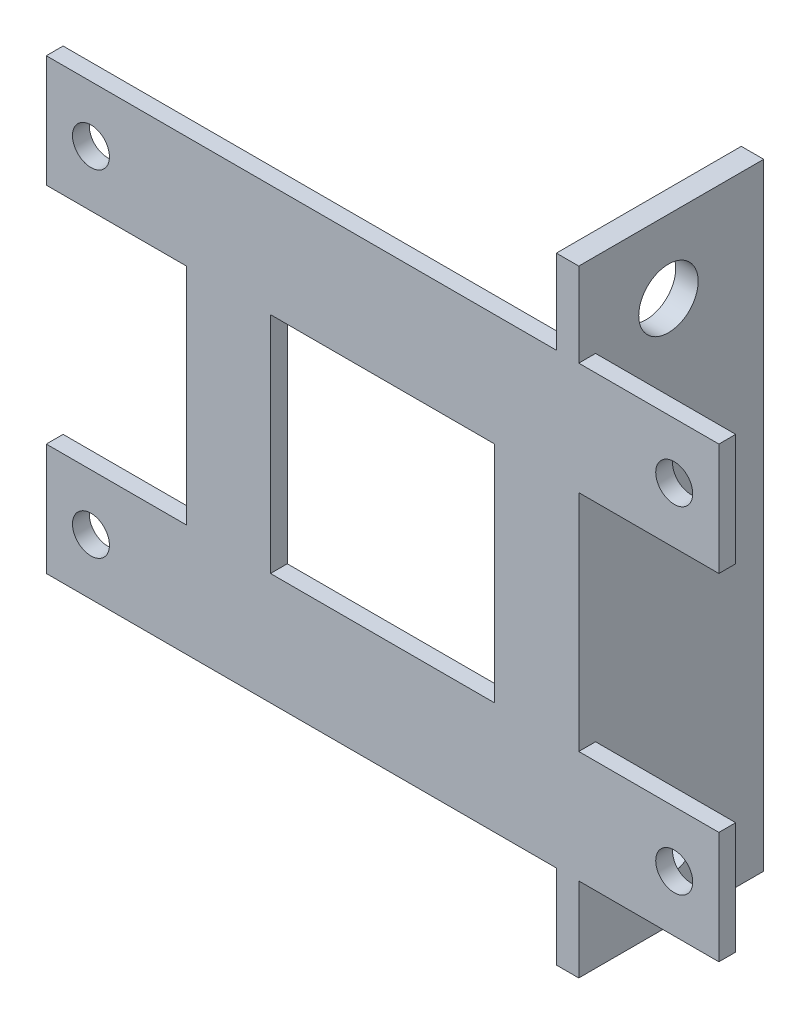
ISO-10303-21;
HEADER;
FILE_DESCRIPTION(('STEP AP214'),'2;1');
FILE_NAME('part.step','',(''),(''),'','','');
FILE_SCHEMA(('AUTOMOTIVE_DESIGN { 1 0 10303 214 1 1 1 1 }'));
ENDSEC;
DATA;
#1=APPLICATION_CONTEXT('core data for automotive mechanical design processes');
#2=APPLICATION_PROTOCOL_DEFINITION('international standard','automotive_design',2000,#1);
#3=PRODUCT_CONTEXT('',#1,'mechanical');
#4=PRODUCT('Part','Part','',(#3));
#5=PRODUCT_RELATED_PRODUCT_CATEGORY('part','',(#4));
#6=PRODUCT_DEFINITION_FORMATION('','',#4);
#7=PRODUCT_DEFINITION_CONTEXT('part definition',#1,'design');
#8=PRODUCT_DEFINITION('design','',#6,#7);
#9=PRODUCT_DEFINITION_SHAPE('','',#8);
#10=(LENGTH_UNIT() NAMED_UNIT(*) SI_UNIT(.MILLI.,.METRE.));
#11=(NAMED_UNIT(*) PLANE_ANGLE_UNIT() SI_UNIT($,.RADIAN.));
#12=(NAMED_UNIT(*) SI_UNIT($,.STERADIAN.) SOLID_ANGLE_UNIT());
#13=UNCERTAINTY_MEASURE_WITH_UNIT(LENGTH_MEASURE(1.E-05),#10,'distance_accuracy_value','');
#14=(GEOMETRIC_REPRESENTATION_CONTEXT(3) GLOBAL_UNCERTAINTY_ASSIGNED_CONTEXT((#13)) GLOBAL_UNIT_ASSIGNED_CONTEXT((#10,
#11,#12)) REPRESENTATION_CONTEXT('',''));
#15=CARTESIAN_POINT('',(0.,0.,0.));
#16=DIRECTION('',(0.,0.,1.));
#17=DIRECTION('',(1.,0.,0.));
#18=AXIS2_PLACEMENT_3D('',#15,#16,#17);
#19=CARTESIAN_POINT('',(0.,0.,-36.5));
#20=DIRECTION('',(0.,0.,-1.));
#21=DIRECTION('',(-1.,0.,0.));
#22=AXIS2_PLACEMENT_3D('',#19,#20,#21);
#23=PLANE('',#22);
#24=CARTESIAN_POINT('',(26.0145399892303,-15.,-36.5));
#25=DIRECTION('',(0.,0.,-1.));
#26=DIRECTION('',(-1.,0.,0.));
#27=AXIS2_PLACEMENT_3D('',#24,#25,#26);
#28=CIRCLE('',#27,1.65);
#29=CARTESIAN_POINT('',(24.3645399892303,-15.,-36.5));
#30=VERTEX_POINT('',#29);
#31=EDGE_CURVE('E793',#30,#30,#28,.T.);
#32=ORIENTED_EDGE('',*,*,#31,.F.);
#33=EDGE_LOOP('',(#32));
#34=FACE_BOUND('',#33,.T.);
#35=DIRECTION('',(-1.,0.,0.));
#36=VECTOR('',#35,1.);
#37=CARTESIAN_POINT('',(30.,-20.,-36.5));
#38=LINE('',#37,#36);
#39=CARTESIAN_POINT('',(30.,-20.,-36.5));
#40=VERTEX_POINT('',#39);
#41=CARTESIAN_POINT('',(17.5,-20.,-36.5));
#42=VERTEX_POINT('',#41);
#43=EDGE_CURVE('E305',#40,#42,#38,.T.);
#44=ORIENTED_EDGE('',*,*,#43,.T.);
#45=DIRECTION('',(0.,1.,0.));
#46=VECTOR('',#45,1.);
#47=CARTESIAN_POINT('',(17.5,0.,-36.5));
#48=LINE('',#47,#46);
#49=CARTESIAN_POINT('',(17.5,-10.,-36.5));
#50=VERTEX_POINT('',#49);
#51=EDGE_CURVE('E256',#42,#50,#48,.T.);
#52=ORIENTED_EDGE('',*,*,#51,.T.);
#53=DIRECTION('',(1.,0.,0.));
#54=VECTOR('',#53,1.);
#55=CARTESIAN_POINT('',(22.0290799784607,-10.,-36.5));
#56=LINE('',#55,#54);
#57=CARTESIAN_POINT('',(30.,-10.,-36.5));
#58=VERTEX_POINT('',#57);
#59=EDGE_CURVE('E300',#50,#58,#56,.T.);
#60=ORIENTED_EDGE('',*,*,#59,.T.);
#61=DIRECTION('',(0.,-1.,0.));
#62=VECTOR('',#61,1.);
#63=CARTESIAN_POINT('',(30.,-10.,-36.5));
#64=LINE('',#63,#62);
#65=EDGE_CURVE('E302',#58,#40,#64,.T.);
#66=ORIENTED_EDGE('',*,*,#65,.T.);
#67=EDGE_LOOP('',(#44,#52,#60,#66));
#68=FACE_BOUND('',#67,.T.);
#69=ADVANCED_FACE('F35',(#34,#68),#23,.T.);
#70=CARTESIAN_POINT('',(26.0145399892303,15.,-36.5));
#71=DIRECTION('',(0.,0.,-1.));
#72=DIRECTION('',(-1.,0.,0.));
#73=AXIS2_PLACEMENT_3D('',#70,#71,#72);
#74=CIRCLE('',#73,1.65);
#75=CARTESIAN_POINT('',(24.3645399892303,15.,-36.5));
#76=VERTEX_POINT('',#75);
#77=EDGE_CURVE('E389',#76,#76,#74,.T.);
#78=ORIENTED_EDGE('',*,*,#77,.F.);
#79=EDGE_LOOP('',(#78));
#80=FACE_BOUND('',#79,.T.);
#81=DIRECTION('',(-1.,0.,0.));
#82=VECTOR('',#81,1.);
#83=CARTESIAN_POINT('',(30.,10.,-36.5));
#84=LINE('',#83,#82);
#85=CARTESIAN_POINT('',(30.,10.,-36.5));
#86=VERTEX_POINT('',#85);
#87=CARTESIAN_POINT('',(17.5,10.,-36.5));
#88=VERTEX_POINT('',#87);
#89=EDGE_CURVE('E298',#86,#88,#84,.T.);
#90=ORIENTED_EDGE('',*,*,#89,.T.);
#91=CARTESIAN_POINT('',(17.5,20.,-36.5));
#92=VERTEX_POINT('',#91);
#93=EDGE_CURVE('E52',#88,#92,#48,.T.);
#94=ORIENTED_EDGE('',*,*,#93,.T.);
#95=DIRECTION('',(1.,0.,0.));
#96=VECTOR('',#95,1.);
#97=CARTESIAN_POINT('',(30.,20.,-36.5));
#98=LINE('',#97,#96);
#99=CARTESIAN_POINT('',(30.,20.,-36.5));
#100=VERTEX_POINT('',#99);
#101=EDGE_CURVE('E296',#92,#100,#98,.T.);
#102=ORIENTED_EDGE('',*,*,#101,.T.);
#103=DIRECTION('',(0.,-1.,0.));
#104=VECTOR('',#103,1.);
#105=CARTESIAN_POINT('',(30.,20.,-36.5));
#106=LINE('',#105,#104);
#107=EDGE_CURVE('E295',#100,#86,#106,.T.);
#108=ORIENTED_EDGE('',*,*,#107,.T.);
#109=EDGE_LOOP('',(#90,#94,#102,#108));
#110=FACE_BOUND('',#109,.T.);
#111=ADVANCED_FACE('F427',(#80,#110),#23,.T.);
#112=CARTESIAN_POINT('',(30.,20.,-36.5));
#113=DIRECTION('',(0.,-1.,0.));
#114=DIRECTION('',(1.,0.,0.));
#115=AXIS2_PLACEMENT_3D('',#112,#113,#114);
#116=PLANE('',#115);
#117=DIRECTION('',(0.,0.,-1.));
#118=VECTOR('',#117,1.);
#119=CARTESIAN_POINT('',(17.5,20.,-36.5));
#120=LINE('',#119,#118);
#121=CARTESIAN_POINT('',(17.5,20.,-35.));
#122=VERTEX_POINT('',#121);
#123=EDGE_CURVE('E258',#122,#92,#120,.T.);
#124=ORIENTED_EDGE('',*,*,#123,.F.);
#125=DIRECTION('',(1.,0.,0.));
#126=VECTOR('',#125,1.);
#127=CARTESIAN_POINT('',(30.,20.,-35.));
#128=LINE('',#127,#126);
#129=CARTESIAN_POINT('',(30.,20.,-35.));
#130=VERTEX_POINT('',#129);
#131=EDGE_CURVE('E292',#122,#130,#128,.T.);
#132=ORIENTED_EDGE('',*,*,#131,.T.);
#133=DIRECTION('',(0.,0.,1.));
#134=VECTOR('',#133,1.);
#135=CARTESIAN_POINT('',(30.,20.,-36.5));
#136=LINE('',#135,#134);
#137=EDGE_CURVE('E380',#100,#130,#136,.T.);
#138=ORIENTED_EDGE('',*,*,#137,.F.);
#139=ORIENTED_EDGE('',*,*,#101,.F.);
#140=EDGE_LOOP('',(#124,#132,#138,#139));
#141=FACE_BOUND('',#140,.T.);
#142=ADVANCED_FACE('F434',(#141),#116,.F.);
#143=CARTESIAN_POINT('',(30.,-20.,-36.5));
#144=DIRECTION('',(0.,1.,0.));
#145=DIRECTION('',(-1.,0.,0.));
#146=AXIS2_PLACEMENT_3D('',#143,#144,#145);
#147=PLANE('',#146);
#148=DIRECTION('',(0.,0.,1.));
#149=VECTOR('',#148,1.);
#150=CARTESIAN_POINT('',(17.5,-20.,-36.5));
#151=LINE('',#150,#149);
#152=CARTESIAN_POINT('',(17.5,-20.,-35.));
#153=VERTEX_POINT('',#152);
#154=EDGE_CURVE('E11',#42,#153,#151,.T.);
#155=ORIENTED_EDGE('',*,*,#154,.F.);
#156=ORIENTED_EDGE('',*,*,#43,.F.);
#157=DIRECTION('',(0.,0.,1.));
#158=VECTOR('',#157,1.);
#159=CARTESIAN_POINT('',(30.,-20.,-36.5));
#160=LINE('',#159,#158);
#161=CARTESIAN_POINT('',(30.,-20.,-35.));
#162=VERTEX_POINT('',#161);
#163=EDGE_CURVE('E365',#40,#162,#160,.T.);
#164=ORIENTED_EDGE('',*,*,#163,.T.);
#165=DIRECTION('',(-1.,0.,0.));
#166=VECTOR('',#165,1.);
#167=CARTESIAN_POINT('',(30.,-20.,-35.));
#168=LINE('',#167,#166);
#169=EDGE_CURVE('E334',#162,#153,#168,.T.);
#170=ORIENTED_EDGE('',*,*,#169,.T.);
#171=EDGE_LOOP('',(#155,#156,#164,#170));
#172=FACE_BOUND('',#171,.T.);
#173=ADVANCED_FACE('F442',(#172),#147,.F.);
#174=CARTESIAN_POINT('',(-26.0145399892303,-15.,-36.5));
#175=DIRECTION('',(0.,0.,-1.));
#176=DIRECTION('',(-1.,0.,0.));
#177=AXIS2_PLACEMENT_3D('',#174,#175,#176);
#178=CIRCLE('',#177,1.65);
#179=CARTESIAN_POINT('',(-27.6645399892303,-15.,-36.5));
#180=VERTEX_POINT('',#179);
#181=EDGE_CURVE('E454',#180,#180,#178,.T.);
#182=ORIENTED_EDGE('',*,*,#181,.F.);
#183=EDGE_LOOP('',(#182));
#184=FACE_BOUND('',#183,.T.);
#185=CARTESIAN_POINT('',(-26.0145399892303,15.,-36.5));
#186=DIRECTION('',(0.,0.,-1.));
#187=DIRECTION('',(-1.,0.,0.));
#188=AXIS2_PLACEMENT_3D('',#185,#186,#187);
#189=CIRCLE('',#188,1.65);
#190=CARTESIAN_POINT('',(-27.6645399892303,15.,-36.5));
#191=VERTEX_POINT('',#190);
#192=EDGE_CURVE('E458',#191,#191,#189,.T.);
#193=ORIENTED_EDGE('',*,*,#192,.F.);
#194=EDGE_LOOP('',(#193));
#195=FACE_BOUND('',#194,.T.);
#196=DIRECTION('',(0.,1.,0.));
#197=VECTOR('',#196,1.);
#198=CARTESIAN_POINT('',(15.5,0.,-36.5));
#199=LINE('',#198,#197);
#200=CARTESIAN_POINT('',(15.5,-20.,-36.5));
#201=VERTEX_POINT('',#200);
#202=CARTESIAN_POINT('',(15.5,20.,-36.5));
#203=VERTEX_POINT('',#202);
#204=EDGE_CURVE('E252',#201,#203,#199,.T.);
#205=ORIENTED_EDGE('',*,*,#204,.F.);
#206=CARTESIAN_POINT('',(-30.,-20.,-36.5));
#207=VERTEX_POINT('',#206);
#208=EDGE_CURVE('E304',#201,#207,#38,.T.);
#209=ORIENTED_EDGE('',*,*,#208,.T.);
#210=DIRECTION('',(0.,1.,0.));
#211=VECTOR('',#210,1.);
#212=CARTESIAN_POINT('',(-30.,-10.,-36.5));
#213=LINE('',#212,#211);
#214=CARTESIAN_POINT('',(-30.,-10.,-36.5));
#215=VERTEX_POINT('',#214);
#216=EDGE_CURVE('E308',#207,#215,#213,.T.);
#217=ORIENTED_EDGE('',*,*,#216,.T.);
#218=DIRECTION('',(1.,0.,0.));
#219=VECTOR('',#218,1.);
#220=CARTESIAN_POINT('',(-22.0290799784607,-10.,-36.5));
#221=LINE('',#220,#219);
#222=CARTESIAN_POINT('',(-17.5,-10.,-36.5));
#223=VERTEX_POINT('',#222);
#224=EDGE_CURVE('E310',#215,#223,#221,.T.);
#225=ORIENTED_EDGE('',*,*,#224,.T.);
#226=DIRECTION('',(0.,1.,0.));
#227=VECTOR('',#226,1.);
#228=CARTESIAN_POINT('',(-17.5,10.,-36.5));
#229=LINE('',#228,#227);
#230=CARTESIAN_POINT('',(-17.5,10.,-36.5));
#231=VERTEX_POINT('',#230);
#232=EDGE_CURVE('E312',#223,#231,#229,.T.);
#233=ORIENTED_EDGE('',*,*,#232,.T.);
#234=DIRECTION('',(-1.,0.,0.));
#235=VECTOR('',#234,1.);
#236=CARTESIAN_POINT('',(-22.0290799784607,10.,-36.5));
#237=LINE('',#236,#235);
#238=CARTESIAN_POINT('',(-30.,10.,-36.5));
#239=VERTEX_POINT('',#238);
#240=EDGE_CURVE('E314',#231,#239,#237,.T.);
#241=ORIENTED_EDGE('',*,*,#240,.T.);
#242=DIRECTION('',(0.,1.,0.));
#243=VECTOR('',#242,1.);
#244=CARTESIAN_POINT('',(-30.,10.,-36.5));
#245=LINE('',#244,#243);
#246=CARTESIAN_POINT('',(-30.,20.,-36.5));
#247=VERTEX_POINT('',#246);
#248=EDGE_CURVE('E316',#239,#247,#245,.T.);
#249=ORIENTED_EDGE('',*,*,#248,.T.);
#250=EDGE_CURVE('E293',#247,#203,#98,.T.);
#251=ORIENTED_EDGE('',*,*,#250,.T.);
#252=EDGE_LOOP('',(#205,#209,#217,#225,#233,#241,#249,#251));
#253=FACE_BOUND('',#252,.T.);
#254=DIRECTION('',(1.,0.,0.));
#255=VECTOR('',#254,1.);
#256=CARTESIAN_POINT('',(10.,10.,-36.5));
#257=LINE('',#256,#255);
#258=CARTESIAN_POINT('',(-10.,10.,-36.5));
#259=VERTEX_POINT('',#258);
#260=CARTESIAN_POINT('',(10.,10.,-36.5));
#261=VERTEX_POINT('',#260);
#262=EDGE_CURVE('E264',#259,#261,#257,.T.);
#263=ORIENTED_EDGE('',*,*,#262,.F.);
#264=DIRECTION('',(0.,1.,0.));
#265=VECTOR('',#264,1.);
#266=CARTESIAN_POINT('',(-10.,-10.,-36.5));
#267=LINE('',#266,#265);
#268=CARTESIAN_POINT('',(-10.,-10.,-36.5));
#269=VERTEX_POINT('',#268);
#270=EDGE_CURVE('E262',#269,#259,#267,.T.);
#271=ORIENTED_EDGE('',*,*,#270,.F.);
#272=DIRECTION('',(-1.,0.,0.));
#273=VECTOR('',#272,1.);
#274=CARTESIAN_POINT('',(10.,-10.,-36.5));
#275=LINE('',#274,#273);
#276=CARTESIAN_POINT('',(10.,-10.,-36.5));
#277=VERTEX_POINT('',#276);
#278=EDGE_CURVE('E270',#277,#269,#275,.T.);
#279=ORIENTED_EDGE('',*,*,#278,.F.);
#280=DIRECTION('',(0.,-1.,0.));
#281=VECTOR('',#280,1.);
#282=CARTESIAN_POINT('',(10.,-10.,-36.5));
#283=LINE('',#282,#281);
#284=EDGE_CURVE('E267',#261,#277,#283,.T.);
#285=ORIENTED_EDGE('',*,*,#284,.F.);
#286=EDGE_LOOP('',(#263,#271,#279,#285));
#287=FACE_BOUND('',#286,.T.);
#288=ADVANCED_FACE('F430',(#184,#195,#253,#287),#23,.T.);
#289=CARTESIAN_POINT('',(0.,0.,-35.));
#290=DIRECTION('',(0.,0.,-1.));
#291=DIRECTION('',(-1.,0.,0.));
#292=AXIS2_PLACEMENT_3D('',#289,#290,#291);
#293=PLANE('',#292);
#294=CARTESIAN_POINT('',(26.0145399892303,15.,-35.));
#295=DIRECTION('',(0.,0.,-1.));
#296=DIRECTION('',(-1.,0.,0.));
#297=AXIS2_PLACEMENT_3D('',#294,#295,#296);
#298=CIRCLE('',#297,1.65);
#299=CARTESIAN_POINT('',(24.3645399892303,15.,-35.));
#300=VERTEX_POINT('',#299);
#301=EDGE_CURVE('E39',#300,#300,#298,.T.);
#302=ORIENTED_EDGE('',*,*,#301,.T.);
#303=EDGE_LOOP('',(#302));
#304=FACE_BOUND('',#303,.T.);
#305=CARTESIAN_POINT('',(26.0145399892303,-15.,-35.));
#306=DIRECTION('',(0.,0.,-1.));
#307=DIRECTION('',(-1.,0.,0.));
#308=AXIS2_PLACEMENT_3D('',#305,#306,#307);
#309=CIRCLE('',#308,1.65);
#310=CARTESIAN_POINT('',(24.3645399892303,-15.,-35.));
#311=VERTEX_POINT('',#310);
#312=EDGE_CURVE('E391',#311,#311,#309,.T.);
#313=ORIENTED_EDGE('',*,*,#312,.T.);
#314=EDGE_LOOP('',(#313));
#315=FACE_BOUND('',#314,.T.);
#316=CARTESIAN_POINT('',(-26.0145399892303,-15.,-35.));
#317=DIRECTION('',(0.,0.,-1.));
#318=DIRECTION('',(-1.,0.,0.));
#319=AXIS2_PLACEMENT_3D('',#316,#317,#318);
#320=CIRCLE('',#319,1.65);
#321=CARTESIAN_POINT('',(-27.6645399892303,-15.,-35.));
#322=VERTEX_POINT('',#321);
#323=EDGE_CURVE('E388',#322,#322,#320,.T.);
#324=ORIENTED_EDGE('',*,*,#323,.T.);
#325=EDGE_LOOP('',(#324));
#326=FACE_BOUND('',#325,.T.);
#327=CARTESIAN_POINT('',(-26.0145399892303,15.,-35.));
#328=DIRECTION('',(0.,0.,-1.));
#329=DIRECTION('',(-1.,0.,0.));
#330=AXIS2_PLACEMENT_3D('',#327,#328,#329);
#331=CIRCLE('',#330,1.65);
#332=CARTESIAN_POINT('',(-27.6645399892303,15.,-35.));
#333=VERTEX_POINT('',#332);
#334=EDGE_CURVE('E385',#333,#333,#331,.T.);
#335=ORIENTED_EDGE('',*,*,#334,.T.);
#336=EDGE_LOOP('',(#335));
#337=FACE_BOUND('',#336,.T.);
#338=CARTESIAN_POINT('',(15.5,-20.,-35.));
#339=VERTEX_POINT('',#338);
#340=CARTESIAN_POINT('',(-30.,-20.,-35.));
#341=VERTEX_POINT('',#340);
#342=EDGE_CURVE('E333',#339,#341,#168,.T.);
#343=ORIENTED_EDGE('',*,*,#342,.F.);
#344=DIRECTION('',(0.,-1.,0.));
#345=VECTOR('',#344,1.);
#346=CARTESIAN_POINT('',(15.5,0.,-35.));
#347=LINE('',#346,#345);
#348=CARTESIAN_POINT('',(15.5,-27.4999999999999,-35.));
#349=VERTEX_POINT('',#348);
#350=EDGE_CURVE('E244',#339,#349,#347,.T.);
#351=ORIENTED_EDGE('',*,*,#350,.T.);
#352=DIRECTION('',(1.,0.,0.));
#353=VECTOR('',#352,1.);
#354=CARTESIAN_POINT('',(0.,-27.4999999999999,-35.));
#355=LINE('',#354,#353);
#356=CARTESIAN_POINT('',(17.5,-27.4999999999999,-35.));
#357=VERTEX_POINT('',#356);
#358=EDGE_CURVE('E208',#349,#357,#355,.T.);
#359=ORIENTED_EDGE('',*,*,#358,.T.);
#360=DIRECTION('',(0.,-1.,0.));
#361=VECTOR('',#360,1.);
#362=CARTESIAN_POINT('',(17.5,0.,-35.));
#363=LINE('',#362,#361);
#364=EDGE_CURVE('E238',#153,#357,#363,.T.);
#365=ORIENTED_EDGE('',*,*,#364,.F.);
#366=ORIENTED_EDGE('',*,*,#169,.F.);
#367=DIRECTION('',(0.,-1.,0.));
#368=VECTOR('',#367,1.);
#369=CARTESIAN_POINT('',(30.,-10.,-35.));
#370=LINE('',#369,#368);
#371=CARTESIAN_POINT('',(30.,-10.,-35.));
#372=VERTEX_POINT('',#371);
#373=EDGE_CURVE('E331',#372,#162,#370,.T.);
#374=ORIENTED_EDGE('',*,*,#373,.F.);
#375=DIRECTION('',(1.,0.,0.));
#376=VECTOR('',#375,1.);
#377=CARTESIAN_POINT('',(30.,-10.,-35.));
#378=LINE('',#377,#376);
#379=CARTESIAN_POINT('',(17.5,-10.,-35.));
#380=VERTEX_POINT('',#379);
#381=EDGE_CURVE('E329',#380,#372,#378,.T.);
#382=ORIENTED_EDGE('',*,*,#381,.F.);
#383=DIRECTION('',(0.,-1.,0.));
#384=VECTOR('',#383,1.);
#385=CARTESIAN_POINT('',(17.5,10.,-35.));
#386=LINE('',#385,#384);
#387=CARTESIAN_POINT('',(17.5,10.,-35.));
#388=VERTEX_POINT('',#387);
#389=EDGE_CURVE('E326',#388,#380,#386,.T.);
#390=ORIENTED_EDGE('',*,*,#389,.F.);
#391=DIRECTION('',(-1.,0.,0.));
#392=VECTOR('',#391,1.);
#393=CARTESIAN_POINT('',(22.0290799784607,10.,-35.));
#394=LINE('',#393,#392);
#395=CARTESIAN_POINT('',(30.,10.,-35.));
#396=VERTEX_POINT('',#395);
#397=EDGE_CURVE('E324',#396,#388,#394,.T.);
#398=ORIENTED_EDGE('',*,*,#397,.F.);
#399=DIRECTION('',(0.,-1.,0.));
#400=VECTOR('',#399,1.);
#401=CARTESIAN_POINT('',(30.,20.,-35.));
#402=LINE('',#401,#400);
#403=EDGE_CURVE('E321',#130,#396,#402,.T.);
#404=ORIENTED_EDGE('',*,*,#403,.F.);
#405=ORIENTED_EDGE('',*,*,#131,.F.);
#406=CARTESIAN_POINT('',(17.5,27.5000000000001,-35.));
#407=VERTEX_POINT('',#406);
#408=EDGE_CURVE('E240',#407,#122,#363,.T.);
#409=ORIENTED_EDGE('',*,*,#408,.F.);
#410=DIRECTION('',(1.,0.,0.));
#411=VECTOR('',#410,1.);
#412=CARTESIAN_POINT('',(0.,27.5000000000001,-35.));
#413=LINE('',#412,#411);
#414=CARTESIAN_POINT('',(15.5,27.5000000000001,-35.));
#415=VERTEX_POINT('',#414);
#416=EDGE_CURVE('E235',#415,#407,#413,.T.);
#417=ORIENTED_EDGE('',*,*,#416,.F.);
#418=CARTESIAN_POINT('',(15.5,20.,-35.));
#419=VERTEX_POINT('',#418);
#420=EDGE_CURVE('E249',#415,#419,#347,.T.);
#421=ORIENTED_EDGE('',*,*,#420,.T.);
#422=CARTESIAN_POINT('',(-30.,20.,-35.));
#423=VERTEX_POINT('',#422);
#424=EDGE_CURVE('E319',#423,#419,#128,.T.);
#425=ORIENTED_EDGE('',*,*,#424,.F.);
#426=DIRECTION('',(0.,1.,0.));
#427=VECTOR('',#426,1.);
#428=CARTESIAN_POINT('',(-30.,10.,-35.));
#429=LINE('',#428,#427);
#430=CARTESIAN_POINT('',(-30.,10.,-35.));
#431=VERTEX_POINT('',#430);
#432=EDGE_CURVE('E346',#431,#423,#429,.T.);
#433=ORIENTED_EDGE('',*,*,#432,.F.);
#434=DIRECTION('',(-1.,0.,0.));
#435=VECTOR('',#434,1.);
#436=CARTESIAN_POINT('',(-22.0290799784607,10.,-35.));
#437=LINE('',#436,#435);
#438=CARTESIAN_POINT('',(-17.5,10.,-35.));
#439=VERTEX_POINT('',#438);
#440=EDGE_CURVE('E344',#439,#431,#437,.T.);
#441=ORIENTED_EDGE('',*,*,#440,.F.);
#442=DIRECTION('',(0.,1.,0.));
#443=VECTOR('',#442,1.);
#444=CARTESIAN_POINT('',(-17.5,10.,-35.));
#445=LINE('',#444,#443);
#446=CARTESIAN_POINT('',(-17.5,-10.,-35.));
#447=VERTEX_POINT('',#446);
#448=EDGE_CURVE('E341',#447,#439,#445,.T.);
#449=ORIENTED_EDGE('',*,*,#448,.F.);
#450=DIRECTION('',(1.,0.,0.));
#451=VECTOR('',#450,1.);
#452=CARTESIAN_POINT('',(-22.0290799784607,-10.,-35.));
#453=LINE('',#452,#451);
#454=CARTESIAN_POINT('',(-30.,-10.,-35.));
#455=VERTEX_POINT('',#454);
#456=EDGE_CURVE('E339',#455,#447,#453,.T.);
#457=ORIENTED_EDGE('',*,*,#456,.F.);
#458=DIRECTION('',(0.,1.,0.));
#459=VECTOR('',#458,1.);
#460=CARTESIAN_POINT('',(-30.,-10.,-35.));
#461=LINE('',#460,#459);
#462=EDGE_CURVE('E336',#341,#455,#461,.T.);
#463=ORIENTED_EDGE('',*,*,#462,.F.);
#464=EDGE_LOOP('',(#343,#351,#359,#365,#366,#374,#382,#390,#398,#404,#405,#409,#417,#421,#425,
#433,#441,#449,#457,#463));
#465=FACE_BOUND('',#464,.T.);
#466=DIRECTION('',(0.,1.,0.));
#467=VECTOR('',#466,1.);
#468=CARTESIAN_POINT('',(-10.,-10.,-35.));
#469=LINE('',#468,#467);
#470=CARTESIAN_POINT('',(-10.,-10.,-35.));
#471=VERTEX_POINT('',#470);
#472=CARTESIAN_POINT('',(-10.,10.,-35.));
#473=VERTEX_POINT('',#472);
#474=EDGE_CURVE('E261',#471,#473,#469,.T.);
#475=ORIENTED_EDGE('',*,*,#474,.T.);
#476=DIRECTION('',(1.,0.,0.));
#477=VECTOR('',#476,1.);
#478=CARTESIAN_POINT('',(10.,10.,-35.));
#479=LINE('',#478,#477);
#480=CARTESIAN_POINT('',(10.,10.,-35.));
#481=VERTEX_POINT('',#480);
#482=EDGE_CURVE('E275',#473,#481,#479,.T.);
#483=ORIENTED_EDGE('',*,*,#482,.T.);
#484=DIRECTION('',(0.,-1.,0.));
#485=VECTOR('',#484,1.);
#486=CARTESIAN_POINT('',(10.,-10.,-35.));
#487=LINE('',#486,#485);
#488=CARTESIAN_POINT('',(10.,-10.,-35.));
#489=VERTEX_POINT('',#488);
#490=EDGE_CURVE('E278',#481,#489,#487,.T.);
#491=ORIENTED_EDGE('',*,*,#490,.T.);
#492=DIRECTION('',(-1.,0.,0.));
#493=VECTOR('',#492,1.);
#494=CARTESIAN_POINT('',(10.,-10.,-35.));
#495=LINE('',#494,#493);
#496=EDGE_CURVE('E265',#489,#471,#495,.T.);
#497=ORIENTED_EDGE('',*,*,#496,.T.);
#498=EDGE_LOOP('',(#475,#483,#491,#497));
#499=FACE_BOUND('',#498,.T.);
#500=ADVANCED_FACE('F441',(#304,#315,#326,#337,#465,#499),#293,.F.);
#501=ORIENTED_EDGE('',*,*,#424,.T.);
#502=DIRECTION('',(0.,0.,-1.));
#503=VECTOR('',#502,1.);
#504=CARTESIAN_POINT('',(15.5,20.,-36.5));
#505=LINE('',#504,#503);
#506=EDGE_CURVE('E60',#419,#203,#505,.T.);
#507=ORIENTED_EDGE('',*,*,#506,.T.);
#508=ORIENTED_EDGE('',*,*,#250,.F.);
#509=DIRECTION('',(0.,0.,1.));
#510=VECTOR('',#509,1.);
#511=CARTESIAN_POINT('',(-30.,20.,-36.5));
#512=LINE('',#511,#510);
#513=EDGE_CURVE('E318',#247,#423,#512,.T.);
#514=ORIENTED_EDGE('',*,*,#513,.T.);
#515=EDGE_LOOP('',(#501,#507,#508,#514));
#516=FACE_BOUND('',#515,.T.);
#517=ADVANCED_FACE('F37',(#516),#116,.F.);
#518=CARTESIAN_POINT('',(30.,20.,-36.5));
#519=DIRECTION('',(-1.,0.,0.));
#520=DIRECTION('',(0.,0.,1.));
#521=AXIS2_PLACEMENT_3D('',#518,#519,#520);
#522=PLANE('',#521);
#523=ORIENTED_EDGE('',*,*,#403,.T.);
#524=DIRECTION('',(0.,0.,1.));
#525=VECTOR('',#524,1.);
#526=CARTESIAN_POINT('',(30.,10.,-36.5));
#527=LINE('',#526,#525);
#528=EDGE_CURVE('E377',#86,#396,#527,.T.);
#529=ORIENTED_EDGE('',*,*,#528,.F.);
#530=ORIENTED_EDGE('',*,*,#107,.F.);
#531=ORIENTED_EDGE('',*,*,#137,.T.);
#532=EDGE_LOOP('',(#523,#529,#530,#531));
#533=FACE_BOUND('',#532,.T.);
#534=ADVANCED_FACE('F532',(#533),#522,.F.);
#535=CARTESIAN_POINT('',(22.0290799784607,10.,-36.5));
#536=DIRECTION('',(0.,1.,0.));
#537=DIRECTION('',(0.,0.,1.));
#538=AXIS2_PLACEMENT_3D('',#535,#536,#537);
#539=PLANE('',#538);
#540=ORIENTED_EDGE('',*,*,#397,.T.);
#541=DIRECTION('',(0.,0.,1.));
#542=VECTOR('',#541,1.);
#543=CARTESIAN_POINT('',(17.5,10.,-36.5));
#544=LINE('',#543,#542);
#545=EDGE_CURVE('E374',#88,#388,#544,.T.);
#546=ORIENTED_EDGE('',*,*,#545,.F.);
#547=ORIENTED_EDGE('',*,*,#89,.F.);
#548=ORIENTED_EDGE('',*,*,#528,.T.);
#549=EDGE_LOOP('',(#540,#546,#547,#548));
#550=FACE_BOUND('',#549,.T.);
#551=ADVANCED_FACE('F529',(#550),#539,.F.);
#552=CARTESIAN_POINT('',(17.5,10.,-36.5));
#553=DIRECTION('',(-1.,0.,0.));
#554=DIRECTION('',(0.,0.,1.));
#555=AXIS2_PLACEMENT_3D('',#552,#553,#554);
#556=PLANE('',#555);
#557=CARTESIAN_POINT('',(17.5,21.,-43.));
#558=DIRECTION('',(-1.,0.,0.));
#559=DIRECTION('',(0.,0.,1.));
#560=AXIS2_PLACEMENT_3D('',#557,#558,#559);
#561=CIRCLE('',#560,2.65);
#562=CARTESIAN_POINT('',(17.5,21.,-40.35));
#563=VERTEX_POINT('',#562);
#564=EDGE_CURVE('E226',#563,#563,#561,.T.);
#565=ORIENTED_EDGE('',*,*,#564,.T.);
#566=EDGE_LOOP('',(#565));
#567=FACE_BOUND('',#566,.T.);
#568=CARTESIAN_POINT('',(17.5,-21.,-43.));
#569=DIRECTION('',(-1.,0.,0.));
#570=DIRECTION('',(0.,0.,1.));
#571=AXIS2_PLACEMENT_3D('',#568,#569,#570);
#572=CIRCLE('',#571,2.64999999999803);
#573=CARTESIAN_POINT('',(17.5,-21.,-40.350000000002));
#574=VERTEX_POINT('',#573);
#575=EDGE_CURVE('E229',#574,#574,#572,.T.);
#576=ORIENTED_EDGE('',*,*,#575,.T.);
#577=EDGE_LOOP('',(#576));
#578=FACE_BOUND('',#577,.T.);
#579=ORIENTED_EDGE('',*,*,#389,.T.);
#580=DIRECTION('',(0.,0.,1.));
#581=VECTOR('',#580,1.);
#582=CARTESIAN_POINT('',(17.5,-10.,-36.5));
#583=LINE('',#582,#581);
#584=EDGE_CURVE('E371',#50,#380,#583,.T.);
#585=ORIENTED_EDGE('',*,*,#584,.F.);
#586=ORIENTED_EDGE('',*,*,#51,.F.);
#587=ORIENTED_EDGE('',*,*,#154,.T.);
#588=ORIENTED_EDGE('',*,*,#364,.T.);
#589=DIRECTION('',(0.,0.,-1.));
#590=VECTOR('',#589,1.);
#591=CARTESIAN_POINT('',(17.5,-27.4999999999999,20.0363516232681));
#592=LINE('',#591,#590);
#593=CARTESIAN_POINT('',(17.5,-27.4999999999999,-51.5));
#594=VERTEX_POINT('',#593);
#595=EDGE_CURVE('E239',#357,#594,#592,.T.);
#596=ORIENTED_EDGE('',*,*,#595,.T.);
#597=DIRECTION('',(0.,1.,0.));
#598=VECTOR('',#597,1.);
#599=CARTESIAN_POINT('',(17.5,0.,-51.5));
#600=LINE('',#599,#598);
#601=CARTESIAN_POINT('',(17.5,27.5000000000001,-51.5));
#602=VERTEX_POINT('',#601);
#603=EDGE_CURVE('E212',#594,#602,#600,.T.);
#604=ORIENTED_EDGE('',*,*,#603,.T.);
#605=DIRECTION('',(0.,0.,-1.));
#606=VECTOR('',#605,1.);
#607=CARTESIAN_POINT('',(17.5,27.5000000000001,20.0363516232681));
#608=LINE('',#607,#606);
#609=EDGE_CURVE('E246',#407,#602,#608,.T.);
#610=ORIENTED_EDGE('',*,*,#609,.F.);
#611=ORIENTED_EDGE('',*,*,#408,.T.);
#612=ORIENTED_EDGE('',*,*,#123,.T.);
#613=ORIENTED_EDGE('',*,*,#93,.F.);
#614=ORIENTED_EDGE('',*,*,#545,.T.);
#615=EDGE_LOOP('',(#579,#585,#586,#587,#588,#596,#604,#610,#611,#612,#613,#614));
#616=FACE_BOUND('',#615,.T.);
#617=ADVANCED_FACE('F410',(#567,#578,#616),#556,.F.);
#618=CARTESIAN_POINT('',(30.,-10.,-36.5));
#619=DIRECTION('',(0.,-1.,0.));
#620=DIRECTION('',(0.,0.,-1.));
#621=AXIS2_PLACEMENT_3D('',#618,#619,#620);
#622=PLANE('',#621);
#623=ORIENTED_EDGE('',*,*,#381,.T.);
#624=DIRECTION('',(0.,0.,1.));
#625=VECTOR('',#624,1.);
#626=CARTESIAN_POINT('',(30.,-10.,-36.5));
#627=LINE('',#626,#625);
#628=EDGE_CURVE('E368',#58,#372,#627,.T.);
#629=ORIENTED_EDGE('',*,*,#628,.F.);
#630=ORIENTED_EDGE('',*,*,#59,.F.);
#631=ORIENTED_EDGE('',*,*,#584,.T.);
#632=EDGE_LOOP('',(#623,#629,#630,#631));
#633=FACE_BOUND('',#632,.T.);
#634=ADVANCED_FACE('F522',(#633),#622,.F.);
#635=CARTESIAN_POINT('',(30.,-10.,-36.5));
#636=DIRECTION('',(-1.,0.,0.));
#637=DIRECTION('',(0.,-1.,0.));
#638=AXIS2_PLACEMENT_3D('',#635,#636,#637);
#639=PLANE('',#638);
#640=ORIENTED_EDGE('',*,*,#373,.T.);
#641=ORIENTED_EDGE('',*,*,#163,.F.);
#642=ORIENTED_EDGE('',*,*,#65,.F.);
#643=ORIENTED_EDGE('',*,*,#628,.T.);
#644=EDGE_LOOP('',(#640,#641,#642,#643));
#645=FACE_BOUND('',#644,.T.);
#646=ADVANCED_FACE('F518',(#645),#639,.F.);
#647=ORIENTED_EDGE('',*,*,#208,.F.);
#648=DIRECTION('',(0.,0.,1.));
#649=VECTOR('',#648,1.);
#650=CARTESIAN_POINT('',(15.5,-20.,-36.5));
#651=LINE('',#650,#649);
#652=EDGE_CURVE('E44',#201,#339,#651,.T.);
#653=ORIENTED_EDGE('',*,*,#652,.T.);
#654=ORIENTED_EDGE('',*,*,#342,.T.);
#655=DIRECTION('',(0.,0.,1.));
#656=VECTOR('',#655,1.);
#657=CARTESIAN_POINT('',(-30.,-20.,-36.5));
#658=LINE('',#657,#656);
#659=EDGE_CURVE('E362',#207,#341,#658,.T.);
#660=ORIENTED_EDGE('',*,*,#659,.F.);
#661=EDGE_LOOP('',(#647,#653,#654,#660));
#662=FACE_BOUND('',#661,.T.);
#663=ADVANCED_FACE('F450',(#662),#147,.F.);
#664=CARTESIAN_POINT('',(-30.,-10.,-36.5));
#665=DIRECTION('',(1.,0.,0.));
#666=DIRECTION('',(0.,1.,0.));
#667=AXIS2_PLACEMENT_3D('',#664,#665,#666);
#668=PLANE('',#667);
#669=ORIENTED_EDGE('',*,*,#462,.T.);
#670=DIRECTION('',(0.,0.,1.));
#671=VECTOR('',#670,1.);
#672=CARTESIAN_POINT('',(-30.,-10.,-36.5));
#673=LINE('',#672,#671);
#674=EDGE_CURVE('E359',#215,#455,#673,.T.);
#675=ORIENTED_EDGE('',*,*,#674,.F.);
#676=ORIENTED_EDGE('',*,*,#216,.F.);
#677=ORIENTED_EDGE('',*,*,#659,.T.);
#678=EDGE_LOOP('',(#669,#675,#676,#677));
#679=FACE_BOUND('',#678,.T.);
#680=ADVANCED_FACE('F512',(#679),#668,.F.);
#681=CARTESIAN_POINT('',(-22.0290799784607,-10.,-36.5));
#682=DIRECTION('',(0.,-1.,0.));
#683=DIRECTION('',(1.,0.,0.));
#684=AXIS2_PLACEMENT_3D('',#681,#682,#683);
#685=PLANE('',#684);
#686=ORIENTED_EDGE('',*,*,#456,.T.);
#687=DIRECTION('',(0.,0.,1.));
#688=VECTOR('',#687,1.);
#689=CARTESIAN_POINT('',(-17.5,-10.,-36.5));
#690=LINE('',#689,#688);
#691=EDGE_CURVE('E356',#223,#447,#690,.T.);
#692=ORIENTED_EDGE('',*,*,#691,.F.);
#693=ORIENTED_EDGE('',*,*,#224,.F.);
#694=ORIENTED_EDGE('',*,*,#674,.T.);
#695=EDGE_LOOP('',(#686,#692,#693,#694));
#696=FACE_BOUND('',#695,.T.);
#697=ADVANCED_FACE('F508',(#696),#685,.F.);
#698=CARTESIAN_POINT('',(-17.5,10.,-36.5));
#699=DIRECTION('',(1.,0.,0.));
#700=DIRECTION('',(0.,1.,0.));
#701=AXIS2_PLACEMENT_3D('',#698,#699,#700);
#702=PLANE('',#701);
#703=ORIENTED_EDGE('',*,*,#448,.T.);
#704=DIRECTION('',(0.,0.,1.));
#705=VECTOR('',#704,1.);
#706=CARTESIAN_POINT('',(-17.5,10.,-36.5));
#707=LINE('',#706,#705);
#708=EDGE_CURVE('E353',#231,#439,#707,.T.);
#709=ORIENTED_EDGE('',*,*,#708,.F.);
#710=ORIENTED_EDGE('',*,*,#232,.F.);
#711=ORIENTED_EDGE('',*,*,#691,.T.);
#712=EDGE_LOOP('',(#703,#709,#710,#711));
#713=FACE_BOUND('',#712,.T.);
#714=ADVANCED_FACE('F502',(#713),#702,.F.);
#715=CARTESIAN_POINT('',(-22.0290799784607,10.,-36.5));
#716=DIRECTION('',(0.,1.,0.));
#717=DIRECTION('',(-1.,0.,0.));
#718=AXIS2_PLACEMENT_3D('',#715,#716,#717);
#719=PLANE('',#718);
#720=ORIENTED_EDGE('',*,*,#440,.T.);
#721=DIRECTION('',(0.,0.,1.));
#722=VECTOR('',#721,1.);
#723=CARTESIAN_POINT('',(-30.,10.,-36.5));
#724=LINE('',#723,#722);
#725=EDGE_CURVE('E350',#239,#431,#724,.T.);
#726=ORIENTED_EDGE('',*,*,#725,.F.);
#727=ORIENTED_EDGE('',*,*,#240,.F.);
#728=ORIENTED_EDGE('',*,*,#708,.T.);
#729=EDGE_LOOP('',(#720,#726,#727,#728));
#730=FACE_BOUND('',#729,.T.);
#731=ADVANCED_FACE('F496',(#730),#719,.F.);
#732=CARTESIAN_POINT('',(-30.,10.,-36.5));
#733=DIRECTION('',(1.,0.,0.));
#734=DIRECTION('',(0.,0.,-1.));
#735=AXIS2_PLACEMENT_3D('',#732,#733,#734);
#736=PLANE('',#735);
#737=ORIENTED_EDGE('',*,*,#432,.T.);
#738=ORIENTED_EDGE('',*,*,#513,.F.);
#739=ORIENTED_EDGE('',*,*,#248,.F.);
#740=ORIENTED_EDGE('',*,*,#725,.T.);
#741=EDGE_LOOP('',(#737,#738,#739,#740));
#742=FACE_BOUND('',#741,.T.);
#743=ADVANCED_FACE('F492',(#742),#736,.F.);
#744=CARTESIAN_POINT('',(-10.,-10.,-36.5));
#745=DIRECTION('',(1.,0.,0.));
#746=DIRECTION('',(0.,0.,-1.));
#747=AXIS2_PLACEMENT_3D('',#744,#745,#746);
#748=PLANE('',#747);
#749=ORIENTED_EDGE('',*,*,#474,.F.);
#750=DIRECTION('',(0.,0.,1.));
#751=VECTOR('',#750,1.);
#752=CARTESIAN_POINT('',(-10.,-10.,-36.5));
#753=LINE('',#752,#751);
#754=EDGE_CURVE('E272',#269,#471,#753,.T.);
#755=ORIENTED_EDGE('',*,*,#754,.F.);
#756=ORIENTED_EDGE('',*,*,#270,.T.);
#757=DIRECTION('',(0.,0.,1.));
#758=VECTOR('',#757,1.);
#759=CARTESIAN_POINT('',(-10.,10.,-36.5));
#760=LINE('',#759,#758);
#761=EDGE_CURVE('E289',#259,#473,#760,.T.);
#762=ORIENTED_EDGE('',*,*,#761,.T.);
#763=EDGE_LOOP('',(#749,#755,#756,#762));
#764=FACE_BOUND('',#763,.T.);
#765=ADVANCED_FACE('F475',(#764),#748,.T.);
#766=CARTESIAN_POINT('',(10.,10.,-36.5));
#767=DIRECTION('',(0.,-1.,0.));
#768=DIRECTION('',(0.,0.,-1.));
#769=AXIS2_PLACEMENT_3D('',#766,#767,#768);
#770=PLANE('',#769);
#771=ORIENTED_EDGE('',*,*,#482,.F.);
#772=ORIENTED_EDGE('',*,*,#761,.F.);
#773=ORIENTED_EDGE('',*,*,#262,.T.);
#774=DIRECTION('',(0.,0.,1.));
#775=VECTOR('',#774,1.);
#776=CARTESIAN_POINT('',(10.,10.,-36.5));
#777=LINE('',#776,#775);
#778=EDGE_CURVE('E287',#261,#481,#777,.T.);
#779=ORIENTED_EDGE('',*,*,#778,.T.);
#780=EDGE_LOOP('',(#771,#772,#773,#779));
#781=FACE_BOUND('',#780,.T.);
#782=ADVANCED_FACE('F468',(#781),#770,.T.);
#783=CARTESIAN_POINT('',(10.,-10.,-36.5));
#784=DIRECTION('',(-1.,0.,0.));
#785=DIRECTION('',(0.,0.,1.));
#786=AXIS2_PLACEMENT_3D('',#783,#784,#785);
#787=PLANE('',#786);
#788=ORIENTED_EDGE('',*,*,#490,.F.);
#789=ORIENTED_EDGE('',*,*,#778,.F.);
#790=ORIENTED_EDGE('',*,*,#284,.T.);
#791=DIRECTION('',(0.,0.,1.));
#792=VECTOR('',#791,1.);
#793=CARTESIAN_POINT('',(10.,-10.,-36.5));
#794=LINE('',#793,#792);
#795=EDGE_CURVE('E285',#277,#489,#794,.T.);
#796=ORIENTED_EDGE('',*,*,#795,.T.);
#797=EDGE_LOOP('',(#788,#789,#790,#796));
#798=FACE_BOUND('',#797,.T.);
#799=ADVANCED_FACE('F471',(#798),#787,.T.);
#800=CARTESIAN_POINT('',(10.,-10.,-36.5));
#801=DIRECTION('',(0.,1.,0.));
#802=DIRECTION('',(0.,0.,1.));
#803=AXIS2_PLACEMENT_3D('',#800,#801,#802);
#804=PLANE('',#803);
#805=ORIENTED_EDGE('',*,*,#496,.F.);
#806=ORIENTED_EDGE('',*,*,#795,.F.);
#807=ORIENTED_EDGE('',*,*,#278,.T.);
#808=ORIENTED_EDGE('',*,*,#754,.T.);
#809=EDGE_LOOP('',(#805,#806,#807,#808));
#810=FACE_BOUND('',#809,.T.);
#811=ADVANCED_FACE('F478',(#810),#804,.T.);
#812=CARTESIAN_POINT('',(15.5,0.,20.0363516232681));
#813=DIRECTION('',(-1.,0.,0.));
#814=DIRECTION('',(0.,0.,1.));
#815=AXIS2_PLACEMENT_3D('',#812,#813,#814);
#816=PLANE('',#815);
#817=CARTESIAN_POINT('',(15.5,21.,-43.));
#818=DIRECTION('',(-1.,0.,0.));
#819=DIRECTION('',(0.,0.,1.));
#820=AXIS2_PLACEMENT_3D('',#817,#818,#819);
#821=CIRCLE('',#820,2.65);
#822=CARTESIAN_POINT('',(15.5,21.,-40.35));
#823=VERTEX_POINT('',#822);
#824=EDGE_CURVE('E400',#823,#823,#821,.T.);
#825=ORIENTED_EDGE('',*,*,#824,.F.);
#826=EDGE_LOOP('',(#825));
#827=FACE_BOUND('',#826,.T.);
#828=CARTESIAN_POINT('',(15.5,-21.,-43.));
#829=DIRECTION('',(-1.,0.,0.));
#830=DIRECTION('',(0.,0.,-1.));
#831=AXIS2_PLACEMENT_3D('',#828,#829,#830);
#832=CIRCLE('',#831,2.64999999999803);
#833=CARTESIAN_POINT('',(15.5,-21.,-45.649999999998));
#834=VERTEX_POINT('',#833);
#835=EDGE_CURVE('E396',#834,#834,#832,.T.);
#836=ORIENTED_EDGE('',*,*,#835,.F.);
#837=EDGE_LOOP('',(#836));
#838=FACE_BOUND('',#837,.T.);
#839=ORIENTED_EDGE('',*,*,#506,.F.);
#840=ORIENTED_EDGE('',*,*,#420,.F.);
#841=DIRECTION('',(0.,0.,-1.));
#842=VECTOR('',#841,1.);
#843=CARTESIAN_POINT('',(15.5,27.5000000000001,20.0363516232681));
#844=LINE('',#843,#842);
#845=CARTESIAN_POINT('',(15.5,27.5000000000001,-51.5));
#846=VERTEX_POINT('',#845);
#847=EDGE_CURVE('E211',#415,#846,#844,.T.);
#848=ORIENTED_EDGE('',*,*,#847,.T.);
#849=DIRECTION('',(0.,1.,0.));
#850=VECTOR('',#849,1.);
#851=CARTESIAN_POINT('',(15.5,0.,-51.5));
#852=LINE('',#851,#850);
#853=CARTESIAN_POINT('',(15.5,-27.4999999999999,-51.5));
#854=VERTEX_POINT('',#853);
#855=EDGE_CURVE('E215',#854,#846,#852,.T.);
#856=ORIENTED_EDGE('',*,*,#855,.F.);
#857=DIRECTION('',(0.,0.,-1.));
#858=VECTOR('',#857,1.);
#859=CARTESIAN_POINT('',(15.5,-27.4999999999999,20.0363516232681));
#860=LINE('',#859,#858);
#861=EDGE_CURVE('E200',#349,#854,#860,.T.);
#862=ORIENTED_EDGE('',*,*,#861,.F.);
#863=ORIENTED_EDGE('',*,*,#350,.F.);
#864=ORIENTED_EDGE('',*,*,#652,.F.);
#865=ORIENTED_EDGE('',*,*,#204,.T.);
#866=EDGE_LOOP('',(#839,#840,#848,#856,#862,#863,#864,#865));
#867=FACE_BOUND('',#866,.T.);
#868=ADVANCED_FACE('F216',(#827,#838,#867),#816,.T.);
#869=CARTESIAN_POINT('',(0.,-27.4999999999999,20.0363516232681));
#870=DIRECTION('',(0.,-1.,0.));
#871=DIRECTION('',(0.,0.,-1.));
#872=AXIS2_PLACEMENT_3D('',#869,#870,#871);
#873=PLANE('',#872);
#874=ORIENTED_EDGE('',*,*,#358,.F.);
#875=ORIENTED_EDGE('',*,*,#861,.T.);
#876=DIRECTION('',(-1.,0.,0.));
#877=VECTOR('',#876,1.);
#878=CARTESIAN_POINT('',(0.,-27.4999999999999,-51.5));
#879=LINE('',#878,#877);
#880=EDGE_CURVE('E205',#594,#854,#879,.T.);
#881=ORIENTED_EDGE('',*,*,#880,.F.);
#882=ORIENTED_EDGE('',*,*,#595,.F.);
#883=EDGE_LOOP('',(#874,#875,#881,#882));
#884=FACE_BOUND('',#883,.T.);
#885=ADVANCED_FACE('F202',(#884),#873,.T.);
#886=CARTESIAN_POINT('',(0.,27.5000000000001,20.0363516232681));
#887=DIRECTION('',(0.,-1.,0.));
#888=DIRECTION('',(0.,0.,-1.));
#889=AXIS2_PLACEMENT_3D('',#886,#887,#888);
#890=PLANE('',#889);
#891=ORIENTED_EDGE('',*,*,#847,.F.);
#892=ORIENTED_EDGE('',*,*,#416,.T.);
#893=ORIENTED_EDGE('',*,*,#609,.T.);
#894=DIRECTION('',(-1.,0.,0.));
#895=VECTOR('',#894,1.);
#896=CARTESIAN_POINT('',(0.,27.5000000000001,-51.5));
#897=LINE('',#896,#895);
#898=EDGE_CURVE('E222',#602,#846,#897,.T.);
#899=ORIENTED_EDGE('',*,*,#898,.T.);
#900=EDGE_LOOP('',(#891,#892,#893,#899));
#901=FACE_BOUND('',#900,.T.);
#902=ADVANCED_FACE('F424',(#901),#890,.F.);
#903=CARTESIAN_POINT('',(0.,0.,-51.5));
#904=DIRECTION('',(0.,0.,-1.));
#905=DIRECTION('',(-1.,0.,0.));
#906=AXIS2_PLACEMENT_3D('',#903,#904,#905);
#907=PLANE('',#906);
#908=ORIENTED_EDGE('',*,*,#880,.T.);
#909=ORIENTED_EDGE('',*,*,#855,.T.);
#910=ORIENTED_EDGE('',*,*,#898,.F.);
#911=ORIENTED_EDGE('',*,*,#603,.F.);
#912=EDGE_LOOP('',(#908,#909,#910,#911));
#913=FACE_BOUND('',#912,.T.);
#914=ADVANCED_FACE('F224',(#913),#907,.T.);
#915=CARTESIAN_POINT('',(44.5,-21.,-43.));
#916=DIRECTION('',(-1.,0.,0.));
#917=DIRECTION('',(0.,0.,1.));
#918=AXIS2_PLACEMENT_3D('',#915,#916,#917);
#919=CYLINDRICAL_SURFACE('',#918,2.64999999999803);
#920=ORIENTED_EDGE('',*,*,#835,.T.);
#921=EDGE_LOOP('',(#920));
#922=FACE_BOUND('',#921,.T.);
#923=ORIENTED_EDGE('',*,*,#575,.F.);
#924=EDGE_LOOP('',(#923));
#925=FACE_BOUND('',#924,.T.);
#926=ADVANCED_FACE('F413',(#922,#925),#919,.F.);
#927=CARTESIAN_POINT('',(44.5,21.,-43.));
#928=DIRECTION('',(-1.,0.,0.));
#929=DIRECTION('',(0.,0.,1.));
#930=AXIS2_PLACEMENT_3D('',#927,#928,#929);
#931=CYLINDRICAL_SURFACE('',#930,2.65);
#932=ORIENTED_EDGE('',*,*,#824,.T.);
#933=EDGE_LOOP('',(#932));
#934=FACE_BOUND('',#933,.T.);
#935=ORIENTED_EDGE('',*,*,#564,.F.);
#936=EDGE_LOOP('',(#935));
#937=FACE_BOUND('',#936,.T.);
#938=ADVANCED_FACE('F415',(#934,#937),#931,.F.);
#939=CARTESIAN_POINT('',(-26.0145399892303,15.,13.5));
#940=DIRECTION('',(0.,0.,-1.));
#941=DIRECTION('',(-1.,0.,0.));
#942=AXIS2_PLACEMENT_3D('',#939,#940,#941);
#943=CYLINDRICAL_SURFACE('',#942,1.65);
#944=ORIENTED_EDGE('',*,*,#192,.T.);
#945=EDGE_LOOP('',(#944));
#946=FACE_BOUND('',#945,.T.);
#947=ORIENTED_EDGE('',*,*,#334,.F.);
#948=EDGE_LOOP('',(#947));
#949=FACE_BOUND('',#948,.T.);
#950=ADVANCED_FACE('F421',(#946,#949),#943,.F.);
#951=CARTESIAN_POINT('',(-26.0145399892303,-15.,13.5));
#952=DIRECTION('',(0.,0.,-1.));
#953=DIRECTION('',(-1.,0.,0.));
#954=AXIS2_PLACEMENT_3D('',#951,#952,#953);
#955=CYLINDRICAL_SURFACE('',#954,1.65);
#956=ORIENTED_EDGE('',*,*,#181,.T.);
#957=EDGE_LOOP('',(#956));
#958=FACE_BOUND('',#957,.T.);
#959=ORIENTED_EDGE('',*,*,#323,.F.);
#960=EDGE_LOOP('',(#959));
#961=FACE_BOUND('',#960,.T.);
#962=ADVANCED_FACE('F700',(#958,#961),#955,.F.);
#963=CARTESIAN_POINT('',(26.0145399892303,-15.,13.5));
#964=DIRECTION('',(0.,0.,-1.));
#965=DIRECTION('',(-1.,0.,0.));
#966=AXIS2_PLACEMENT_3D('',#963,#964,#965);
#967=CYLINDRICAL_SURFACE('',#966,1.65);
#968=ORIENTED_EDGE('',*,*,#31,.T.);
#969=EDGE_LOOP('',(#968));
#970=FACE_BOUND('',#969,.T.);
#971=ORIENTED_EDGE('',*,*,#312,.F.);
#972=EDGE_LOOP('',(#971));
#973=FACE_BOUND('',#972,.T.);
#974=ADVANCED_FACE('F710',(#970,#973),#967,.F.);
#975=CARTESIAN_POINT('',(26.0145399892303,15.,13.5));
#976=DIRECTION('',(0.,0.,-1.));
#977=DIRECTION('',(-1.,0.,0.));
#978=AXIS2_PLACEMENT_3D('',#975,#976,#977);
#979=CYLINDRICAL_SURFACE('',#978,1.65);
#980=ORIENTED_EDGE('',*,*,#77,.T.);
#981=EDGE_LOOP('',(#980));
#982=FACE_BOUND('',#981,.T.);
#983=ORIENTED_EDGE('',*,*,#301,.F.);
#984=EDGE_LOOP('',(#983));
#985=FACE_BOUND('',#984,.T.);
#986=ADVANCED_FACE('F719',(#982,#985),#979,.F.);
#987=CLOSED_SHELL('',(#69,#111,#142,#173,#288,#500,#517,#534,#551,#617,#634,#646,#663,#680,#697,
#714,#731,#743,#765,#782,#799,#811,#868,#885,#902,#914,#926,#938,#950,#962,#974,#986));
#988=MANIFOLD_SOLID_BREP('B2',#987);
#989=ADVANCED_BREP_SHAPE_REPRESENTATION('',(#18,#988),#14);
#990=SHAPE_DEFINITION_REPRESENTATION(#9,#989);
ENDSEC;
END-ISO-10303-21;
